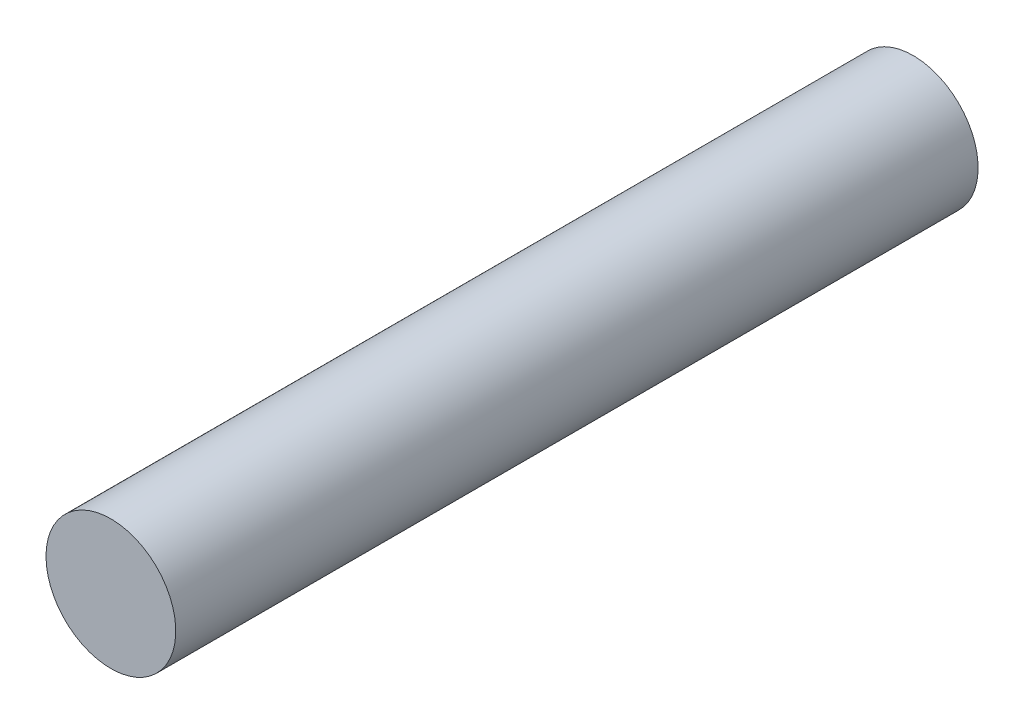
ISO-10303-21;
HEADER;
FILE_DESCRIPTION(('STEP AP214'),'2;1');
FILE_NAME('part.step','',(''),(''),'','','');
FILE_SCHEMA(('AUTOMOTIVE_DESIGN { 1 0 10303 214 1 1 1 1 }'));
ENDSEC;
DATA;
#1=APPLICATION_CONTEXT('core data for automotive mechanical design processes');
#2=APPLICATION_PROTOCOL_DEFINITION('international standard','automotive_design',2000,#1);
#3=PRODUCT_CONTEXT('',#1,'mechanical');
#4=PRODUCT('Part','Part','',(#3));
#5=PRODUCT_RELATED_PRODUCT_CATEGORY('part','',(#4));
#6=PRODUCT_DEFINITION_FORMATION('','',#4);
#7=PRODUCT_DEFINITION_CONTEXT('part definition',#1,'design');
#8=PRODUCT_DEFINITION('design','',#6,#7);
#9=PRODUCT_DEFINITION_SHAPE('','',#8);
#10=(LENGTH_UNIT() NAMED_UNIT(*) SI_UNIT(.MILLI.,.METRE.));
#11=(NAMED_UNIT(*) PLANE_ANGLE_UNIT() SI_UNIT($,.RADIAN.));
#12=(NAMED_UNIT(*) SI_UNIT($,.STERADIAN.) SOLID_ANGLE_UNIT());
#13=UNCERTAINTY_MEASURE_WITH_UNIT(LENGTH_MEASURE(1.E-05),#10,'distance_accuracy_value','');
#14=(GEOMETRIC_REPRESENTATION_CONTEXT(3) GLOBAL_UNCERTAINTY_ASSIGNED_CONTEXT((#13)) GLOBAL_UNIT_ASSIGNED_CONTEXT((#10,
#11,#12)) REPRESENTATION_CONTEXT('',''));
#15=CARTESIAN_POINT('',(0.,0.,0.));
#16=DIRECTION('',(0.,0.,1.));
#17=DIRECTION('',(1.,0.,0.));
#18=AXIS2_PLACEMENT_3D('',#15,#16,#17);
#19=CARTESIAN_POINT('',(10.5,0.,130.));
#20=DIRECTION('',(0.,0.,-1.));
#21=DIRECTION('',(-1.,0.,0.));
#22=AXIS2_PLACEMENT_3D('',#19,#20,#21);
#23=CYLINDRICAL_SURFACE('',#22,10.5117353913099);
#24=CARTESIAN_POINT('',(10.5,0.,130.));
#25=DIRECTION('',(0.,0.,-1.));
#26=DIRECTION('',(-1.,0.,0.));
#27=AXIS2_PLACEMENT_3D('',#24,#25,#26);
#28=CIRCLE('',#27,10.5117353913099);
#29=CARTESIAN_POINT('',(-0.0117353913098566,0.,130.));
#30=VERTEX_POINT('',#29);
#31=EDGE_CURVE('E10',#30,#30,#28,.T.);
#32=ORIENTED_EDGE('',*,*,#31,.T.);
#33=EDGE_LOOP('',(#32));
#34=FACE_BOUND('',#33,.T.);
#35=CARTESIAN_POINT('',(10.5,0.,0.));
#36=DIRECTION('',(0.,0.,-1.));
#37=DIRECTION('',(-1.,0.,0.));
#38=AXIS2_PLACEMENT_3D('',#35,#36,#37);
#39=CIRCLE('',#38,10.5117353913099);
#40=CARTESIAN_POINT('',(-0.0117353913098566,0.,0.));
#41=VERTEX_POINT('',#40);
#42=EDGE_CURVE('E41',#41,#41,#39,.T.);
#43=ORIENTED_EDGE('',*,*,#42,.F.);
#44=EDGE_LOOP('',(#43));
#45=FACE_BOUND('',#44,.T.);
#46=ADVANCED_FACE('F37',(#34,#45),#23,.T.);
#47=CARTESIAN_POINT('',(10.5,0.,130.));
#48=DIRECTION('',(0.,0.,-1.));
#49=DIRECTION('',(-1.,0.,0.));
#50=AXIS2_PLACEMENT_3D('',#47,#48,#49);
#51=PLANE('',#50);
#52=ORIENTED_EDGE('',*,*,#31,.F.);
#53=EDGE_LOOP('',(#52));
#54=FACE_BOUND('',#53,.T.);
#55=ADVANCED_FACE('F52',(#54),#51,.F.);
#56=CARTESIAN_POINT('',(10.5,0.,0.));
#57=DIRECTION('',(0.,0.,-1.));
#58=DIRECTION('',(-1.,0.,0.));
#59=AXIS2_PLACEMENT_3D('',#56,#57,#58);
#60=PLANE('',#59);
#61=ORIENTED_EDGE('',*,*,#42,.T.);
#62=EDGE_LOOP('',(#61));
#63=FACE_BOUND('',#62,.T.);
#64=ADVANCED_FACE('F39',(#63),#60,.T.);
#65=CLOSED_SHELL('',(#46,#55,#64));
#66=MANIFOLD_SOLID_BREP('B2',#65);
#67=ADVANCED_BREP_SHAPE_REPRESENTATION('',(#18,#66),#14);
#68=SHAPE_DEFINITION_REPRESENTATION(#9,#67);
ENDSEC;
END-ISO-10303-21;
